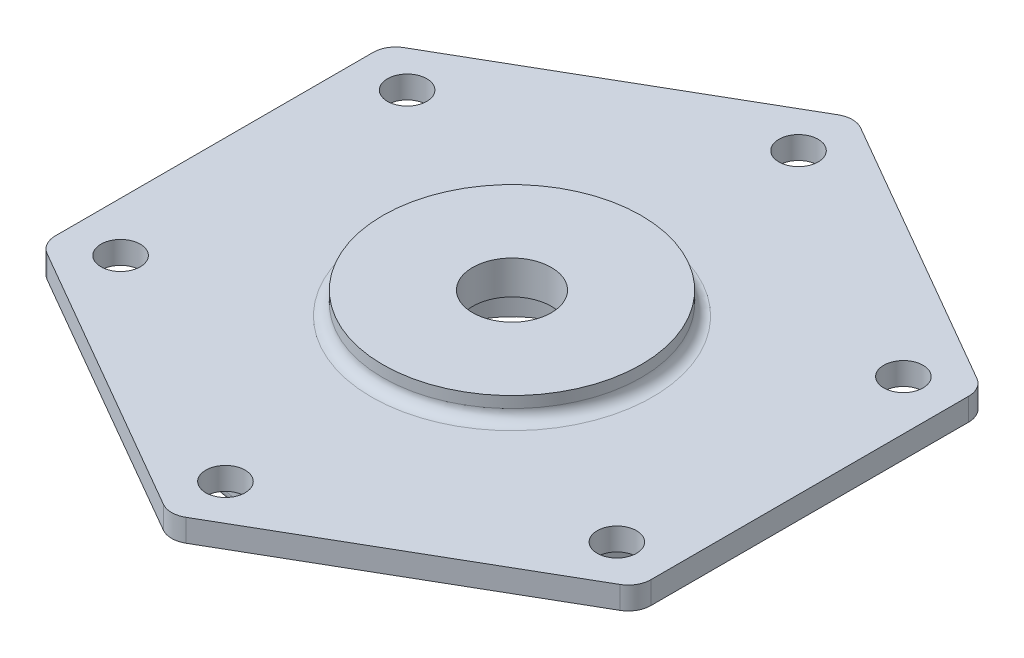
ISO-10303-21;
HEADER;
FILE_DESCRIPTION(('STEP AP214'),'2;1');
FILE_NAME('part.step','',(''),(''),'','','');
FILE_SCHEMA(('AUTOMOTIVE_DESIGN { 1 0 10303 214 1 1 1 1 }'));
ENDSEC;
DATA;
#1=APPLICATION_CONTEXT('core data for automotive mechanical design processes');
#2=APPLICATION_PROTOCOL_DEFINITION('international standard','automotive_design',2000,#1);
#3=PRODUCT_CONTEXT('',#1,'mechanical');
#4=PRODUCT('Part','Part','',(#3));
#5=PRODUCT_RELATED_PRODUCT_CATEGORY('part','',(#4));
#6=PRODUCT_DEFINITION_FORMATION('','',#4);
#7=PRODUCT_DEFINITION_CONTEXT('part definition',#1,'design');
#8=PRODUCT_DEFINITION('design','',#6,#7);
#9=PRODUCT_DEFINITION_SHAPE('','',#8);
#10=(LENGTH_UNIT() NAMED_UNIT(*) SI_UNIT(.MILLI.,.METRE.));
#11=(NAMED_UNIT(*) PLANE_ANGLE_UNIT() SI_UNIT($,.RADIAN.));
#12=(NAMED_UNIT(*) SI_UNIT($,.STERADIAN.) SOLID_ANGLE_UNIT());
#13=UNCERTAINTY_MEASURE_WITH_UNIT(LENGTH_MEASURE(1.E-05),#10,'distance_accuracy_value','');
#14=(GEOMETRIC_REPRESENTATION_CONTEXT(3) GLOBAL_UNCERTAINTY_ASSIGNED_CONTEXT((#13)) GLOBAL_UNIT_ASSIGNED_CONTEXT((#10,
#11,#12)) REPRESENTATION_CONTEXT('',''));
#15=CARTESIAN_POINT('',(0.,0.,0.));
#16=DIRECTION('',(0.,0.,1.));
#17=DIRECTION('',(1.,0.,0.));
#18=AXIS2_PLACEMENT_3D('',#15,#16,#17);
#19=CARTESIAN_POINT('',(48.9999999999997,4.,-28.2901631902923));
#20=DIRECTION('',(0.,-1.,0.));
#21=DIRECTION('',(0.,0.,-1.));
#22=AXIS2_PLACEMENT_3D('',#19,#20,#21);
#23=CYLINDRICAL_SURFACE('',#22,4.);
#24=CARTESIAN_POINT('',(48.9999999999997,0.,-28.2901631902923));
#25=DIRECTION('',(0.,1.,0.));
#26=DIRECTION('',(0.,0.,1.));
#27=AXIS2_PLACEMENT_3D('',#24,#25,#26);
#28=CIRCLE('',#27,4.);
#29=CARTESIAN_POINT('',(52.9999999999997,0.,-28.2901631902923));
#30=VERTEX_POINT('',#29);
#31=CARTESIAN_POINT('',(50.9999999999997,0.,-31.7542648054301));
#32=VERTEX_POINT('',#31);
#33=EDGE_CURVE('E167',#30,#32,#28,.T.);
#34=ORIENTED_EDGE('',*,*,#33,.T.);
#35=DIRECTION('',(0.,-1.,0.));
#36=VECTOR('',#35,1.);
#37=CARTESIAN_POINT('',(50.9999999999997,4.,-31.7542648054301));
#38=LINE('',#37,#36);
#39=CARTESIAN_POINT('',(50.9999999999997,4.,-31.7542648054301));
#40=VERTEX_POINT('',#39);
#41=EDGE_CURVE('E237',#40,#32,#38,.T.);
#42=ORIENTED_EDGE('',*,*,#41,.F.);
#43=CARTESIAN_POINT('',(48.9999999999997,4.,-28.2901631902923));
#44=DIRECTION('',(0.,1.,0.));
#45=DIRECTION('',(0.,0.,1.));
#46=AXIS2_PLACEMENT_3D('',#43,#44,#45);
#47=CIRCLE('',#46,4.);
#48=CARTESIAN_POINT('',(52.9999999999997,4.,-28.2901631902923));
#49=VERTEX_POINT('',#48);
#50=EDGE_CURVE('E202',#49,#40,#47,.T.);
#51=ORIENTED_EDGE('',*,*,#50,.F.);
#52=DIRECTION('',(0.,-1.,0.));
#53=VECTOR('',#52,1.);
#54=CARTESIAN_POINT('',(52.9999999999997,4.,-28.2901631902923));
#55=LINE('',#54,#53);
#56=EDGE_CURVE('E163',#49,#30,#55,.T.);
#57=ORIENTED_EDGE('',*,*,#56,.T.);
#58=EDGE_LOOP('',(#34,#42,#51,#57));
#59=FACE_BOUND('',#58,.T.);
#60=ADVANCED_FACE('F38',(#59),#23,.T.);
#61=CARTESIAN_POINT('',(50.9999999999997,4.,-31.7542648054301));
#62=DIRECTION('',(-0.499999999999995,0.,0.866025403784442));
#63=DIRECTION('',(0.866025403784442,0.,0.499999999999995));
#64=AXIS2_PLACEMENT_3D('',#61,#62,#63);
#65=PLANE('',#64);
#66=DIRECTION('',(-0.866025403784442,0.,-0.499999999999995));
#67=VECTOR('',#66,1.);
#68=CARTESIAN_POINT('',(50.9999999999997,0.,-31.7542648054301));
#69=LINE('',#68,#67);
#70=CARTESIAN_POINT('',(2.00000000000001,0.,-60.0444279957211));
#71=VERTEX_POINT('',#70);
#72=EDGE_CURVE('E171',#32,#71,#69,.T.);
#73=ORIENTED_EDGE('',*,*,#72,.T.);
#74=DIRECTION('',(0.,-1.,0.));
#75=VECTOR('',#74,1.);
#76=CARTESIAN_POINT('',(2.00000000000001,4.,-60.0444279957211));
#77=LINE('',#76,#75);
#78=CARTESIAN_POINT('',(2.00000000000001,4.,-60.0444279957211));
#79=VERTEX_POINT('',#78);
#80=EDGE_CURVE('E233',#79,#71,#77,.T.);
#81=ORIENTED_EDGE('',*,*,#80,.F.);
#82=DIRECTION('',(-0.866025403784442,0.,-0.499999999999995));
#83=VECTOR('',#82,1.);
#84=CARTESIAN_POINT('',(50.9999999999997,4.,-31.7542648054301));
#85=LINE('',#84,#83);
#86=EDGE_CURVE('E114',#40,#79,#85,.T.);
#87=ORIENTED_EDGE('',*,*,#86,.F.);
#88=ORIENTED_EDGE('',*,*,#41,.T.);
#89=EDGE_LOOP('',(#73,#81,#87,#88));
#90=FACE_BOUND('',#89,.T.);
#91=ADVANCED_FACE('F375',(#90),#65,.F.);
#92=CARTESIAN_POINT('',(0.,4.,-56.5803263805834));
#93=DIRECTION('',(0.,-1.,0.));
#94=DIRECTION('',(0.,0.,-1.));
#95=AXIS2_PLACEMENT_3D('',#92,#93,#94);
#96=CYLINDRICAL_SURFACE('',#95,4.);
#97=CARTESIAN_POINT('',(0.,0.,-56.5803263805834));
#98=DIRECTION('',(0.,1.,0.));
#99=DIRECTION('',(0.,0.,-1.));
#100=AXIS2_PLACEMENT_3D('',#97,#98,#99);
#101=CIRCLE('',#100,4.);
#102=CARTESIAN_POINT('',(-2.,0.,-60.0444279957211));
#103=VERTEX_POINT('',#102);
#104=EDGE_CURVE('E175',#71,#103,#101,.T.);
#105=ORIENTED_EDGE('',*,*,#104,.T.);
#106=DIRECTION('',(0.,-1.,0.));
#107=VECTOR('',#106,1.);
#108=CARTESIAN_POINT('',(-2.,4.,-60.0444279957211));
#109=LINE('',#108,#107);
#110=CARTESIAN_POINT('',(-2.,4.,-60.0444279957211));
#111=VERTEX_POINT('',#110);
#112=EDGE_CURVE('E229',#111,#103,#109,.T.);
#113=ORIENTED_EDGE('',*,*,#112,.F.);
#114=CARTESIAN_POINT('',(0.,4.,-56.5803263805834));
#115=DIRECTION('',(0.,1.,0.));
#116=DIRECTION('',(0.,0.,-1.));
#117=AXIS2_PLACEMENT_3D('',#114,#115,#116);
#118=CIRCLE('',#117,4.);
#119=EDGE_CURVE('E327',#79,#111,#118,.T.);
#120=ORIENTED_EDGE('',*,*,#119,.F.);
#121=ORIENTED_EDGE('',*,*,#80,.T.);
#122=EDGE_LOOP('',(#105,#113,#120,#121));
#123=FACE_BOUND('',#122,.T.);
#124=ADVANCED_FACE('F380',(#123),#96,.T.);
#125=CARTESIAN_POINT('',(-2.,4.,-60.0444279957211));
#126=DIRECTION('',(0.500000000000001,0.,0.866025403784438));
#127=DIRECTION('',(0.866025403784438,0.,-0.500000000000001));
#128=AXIS2_PLACEMENT_3D('',#125,#126,#127);
#129=PLANE('',#128);
#130=DIRECTION('',(-0.866025403784438,0.,0.500000000000001));
#131=VECTOR('',#130,1.);
#132=CARTESIAN_POINT('',(-2.,0.,-60.0444279957211));
#133=LINE('',#132,#131);
#134=CARTESIAN_POINT('',(-51.0000000000001,0.,-31.7542648054293));
#135=VERTEX_POINT('',#134);
#136=EDGE_CURVE('E178',#103,#135,#133,.T.);
#137=ORIENTED_EDGE('',*,*,#136,.T.);
#138=DIRECTION('',(0.,-1.,0.));
#139=VECTOR('',#138,1.);
#140=CARTESIAN_POINT('',(-51.0000000000001,4.,-31.7542648054293));
#141=LINE('',#140,#139);
#142=CARTESIAN_POINT('',(-51.0000000000001,4.,-31.7542648054293));
#143=VERTEX_POINT('',#142);
#144=EDGE_CURVE('E225',#143,#135,#141,.T.);
#145=ORIENTED_EDGE('',*,*,#144,.F.);
#146=DIRECTION('',(-0.866025403784438,0.,0.500000000000001));
#147=VECTOR('',#146,1.);
#148=CARTESIAN_POINT('',(-2.,4.,-60.0444279957211));
#149=LINE('',#148,#147);
#150=EDGE_CURVE('E330',#111,#143,#149,.T.);
#151=ORIENTED_EDGE('',*,*,#150,.F.);
#152=ORIENTED_EDGE('',*,*,#112,.T.);
#153=EDGE_LOOP('',(#137,#145,#151,#152));
#154=FACE_BOUND('',#153,.T.);
#155=ADVANCED_FACE('F640',(#154),#129,.F.);
#156=CARTESIAN_POINT('',(-49.0000000000001,4.,-28.2901631902916));
#157=DIRECTION('',(0.,-1.,0.));
#158=DIRECTION('',(0.,0.,-1.));
#159=AXIS2_PLACEMENT_3D('',#156,#157,#158);
#160=CYLINDRICAL_SURFACE('',#159,4.);
#161=CARTESIAN_POINT('',(-49.0000000000001,0.,-28.2901631902916));
#162=DIRECTION('',(0.,1.,0.));
#163=DIRECTION('',(0.,0.,1.));
#164=AXIS2_PLACEMENT_3D('',#161,#162,#163);
#165=CIRCLE('',#164,4.);
#166=CARTESIAN_POINT('',(-53.0000000000001,0.,-28.2901631902915));
#167=VERTEX_POINT('',#166);
#168=EDGE_CURVE('E181',#135,#167,#165,.T.);
#169=ORIENTED_EDGE('',*,*,#168,.T.);
#170=DIRECTION('',(0.,-1.,0.));
#171=VECTOR('',#170,1.);
#172=CARTESIAN_POINT('',(-53.0000000000001,4.,-28.2901631902915));
#173=LINE('',#172,#171);
#174=CARTESIAN_POINT('',(-53.0000000000001,4.,-28.2901631902915));
#175=VERTEX_POINT('',#174);
#176=EDGE_CURVE('E221',#175,#167,#173,.T.);
#177=ORIENTED_EDGE('',*,*,#176,.F.);
#178=CARTESIAN_POINT('',(-49.0000000000001,4.,-28.2901631902916));
#179=DIRECTION('',(0.,1.,0.));
#180=DIRECTION('',(0.,0.,1.));
#181=AXIS2_PLACEMENT_3D('',#178,#179,#180);
#182=CIRCLE('',#181,4.);
#183=EDGE_CURVE('E333',#143,#175,#182,.T.);
#184=ORIENTED_EDGE('',*,*,#183,.F.);
#185=ORIENTED_EDGE('',*,*,#144,.T.);
#186=EDGE_LOOP('',(#169,#177,#184,#185));
#187=FACE_BOUND('',#186,.T.);
#188=ADVANCED_FACE('F630',(#187),#160,.T.);
#189=CARTESIAN_POINT('',(-53.0000000000001,4.,-28.2901631902915));
#190=DIRECTION('',(1.,0.,0.));
#191=DIRECTION('',(0.,0.,-1.));
#192=AXIS2_PLACEMENT_3D('',#189,#190,#191);
#193=PLANE('',#192);
#194=DIRECTION('',(0.,0.,1.));
#195=VECTOR('',#194,1.);
#196=CARTESIAN_POINT('',(-53.0000000000001,0.,-28.2901631902915));
#197=LINE('',#196,#195);
#198=CARTESIAN_POINT('',(-52.9999999999999,0.,28.2901631902919));
#199=VERTEX_POINT('',#198);
#200=EDGE_CURVE('E184',#167,#199,#197,.T.);
#201=ORIENTED_EDGE('',*,*,#200,.T.);
#202=DIRECTION('',(0.,-1.,0.));
#203=VECTOR('',#202,1.);
#204=CARTESIAN_POINT('',(-52.9999999999999,4.,28.2901631902919));
#205=LINE('',#204,#203);
#206=CARTESIAN_POINT('',(-52.9999999999999,4.,28.2901631902919));
#207=VERTEX_POINT('',#206);
#208=EDGE_CURVE('E217',#207,#199,#205,.T.);
#209=ORIENTED_EDGE('',*,*,#208,.F.);
#210=DIRECTION('',(0.,0.,1.));
#211=VECTOR('',#210,1.);
#212=CARTESIAN_POINT('',(-53.0000000000001,4.,-28.2901631902915));
#213=LINE('',#212,#211);
#214=EDGE_CURVE('E336',#175,#207,#213,.T.);
#215=ORIENTED_EDGE('',*,*,#214,.F.);
#216=ORIENTED_EDGE('',*,*,#176,.T.);
#217=EDGE_LOOP('',(#201,#209,#215,#216));
#218=FACE_BOUND('',#217,.T.);
#219=ADVANCED_FACE('F620',(#218),#193,.F.);
#220=CARTESIAN_POINT('',(-48.9999999999999,4.,28.2901631902919));
#221=DIRECTION('',(0.,-1.,0.));
#222=DIRECTION('',(0.,0.,-1.));
#223=AXIS2_PLACEMENT_3D('',#220,#221,#222);
#224=CYLINDRICAL_SURFACE('',#223,4.);
#225=CARTESIAN_POINT('',(-48.9999999999999,0.,28.2901631902919));
#226=DIRECTION('',(0.,1.,0.));
#227=DIRECTION('',(0.,0.,1.));
#228=AXIS2_PLACEMENT_3D('',#225,#226,#227);
#229=CIRCLE('',#228,4.);
#230=CARTESIAN_POINT('',(-50.9999999999999,0.,31.7542648054297));
#231=VERTEX_POINT('',#230);
#232=EDGE_CURVE('E187',#199,#231,#229,.T.);
#233=ORIENTED_EDGE('',*,*,#232,.T.);
#234=DIRECTION('',(0.,-1.,0.));
#235=VECTOR('',#234,1.);
#236=CARTESIAN_POINT('',(-50.9999999999999,4.,31.7542648054297));
#237=LINE('',#236,#235);
#238=CARTESIAN_POINT('',(-50.9999999999999,4.,31.7542648054297));
#239=VERTEX_POINT('',#238);
#240=EDGE_CURVE('E213',#239,#231,#237,.T.);
#241=ORIENTED_EDGE('',*,*,#240,.F.);
#242=CARTESIAN_POINT('',(-48.9999999999999,4.,28.2901631902919));
#243=DIRECTION('',(0.,1.,0.));
#244=DIRECTION('',(0.,0.,1.));
#245=AXIS2_PLACEMENT_3D('',#242,#243,#244);
#246=CIRCLE('',#245,4.);
#247=EDGE_CURVE('E339',#207,#239,#246,.T.);
#248=ORIENTED_EDGE('',*,*,#247,.F.);
#249=ORIENTED_EDGE('',*,*,#208,.T.);
#250=EDGE_LOOP('',(#233,#241,#248,#249));
#251=FACE_BOUND('',#250,.T.);
#252=ADVANCED_FACE('F611',(#251),#224,.T.);
#253=CARTESIAN_POINT('',(-50.9999999999999,4.,31.7542648054297));
#254=DIRECTION('',(0.499999999999995,0.,-0.866025403784442));
#255=DIRECTION('',(-0.866025403784442,0.,-0.499999999999995));
#256=AXIS2_PLACEMENT_3D('',#253,#254,#255);
#257=PLANE('',#256);
#258=DIRECTION('',(0.866025403784442,0.,0.499999999999995));
#259=VECTOR('',#258,1.);
#260=CARTESIAN_POINT('',(-50.9999999999999,0.,31.7542648054297));
#261=LINE('',#260,#259);
#262=CARTESIAN_POINT('',(-1.9999999999996,0.,60.0444279957211));
#263=VERTEX_POINT('',#262);
#264=EDGE_CURVE('E190',#231,#263,#261,.T.);
#265=ORIENTED_EDGE('',*,*,#264,.T.);
#266=DIRECTION('',(0.,-1.,0.));
#267=VECTOR('',#266,1.);
#268=CARTESIAN_POINT('',(-1.9999999999996,4.,60.0444279957211));
#269=LINE('',#268,#267);
#270=CARTESIAN_POINT('',(-1.9999999999996,4.,60.0444279957211));
#271=VERTEX_POINT('',#270);
#272=EDGE_CURVE('E209',#271,#263,#269,.T.);
#273=ORIENTED_EDGE('',*,*,#272,.F.);
#274=DIRECTION('',(0.866025403784442,0.,0.499999999999995));
#275=VECTOR('',#274,1.);
#276=CARTESIAN_POINT('',(-50.9999999999999,4.,31.7542648054297));
#277=LINE('',#276,#275);
#278=EDGE_CURVE('E342',#239,#271,#277,.T.);
#279=ORIENTED_EDGE('',*,*,#278,.F.);
#280=ORIENTED_EDGE('',*,*,#240,.T.);
#281=EDGE_LOOP('',(#265,#273,#279,#280));
#282=FACE_BOUND('',#281,.T.);
#283=ADVANCED_FACE('F350',(#282),#257,.F.);
#284=CARTESIAN_POINT('',(3.96071037428708E-13,4.,56.5803263805834));
#285=DIRECTION('',(0.,-1.,0.));
#286=DIRECTION('',(0.,0.,-1.));
#287=AXIS2_PLACEMENT_3D('',#284,#285,#286);
#288=CYLINDRICAL_SURFACE('',#287,4.);
#289=CARTESIAN_POINT('',(3.96071037428708E-13,0.,56.5803263805834));
#290=DIRECTION('',(0.,1.,0.));
#291=DIRECTION('',(0.,0.,1.));
#292=AXIS2_PLACEMENT_3D('',#289,#290,#291);
#293=CIRCLE('',#292,4.);
#294=CARTESIAN_POINT('',(2.00000000000044,0.,60.0444279957211));
#295=VERTEX_POINT('',#294);
#296=EDGE_CURVE('E193',#263,#295,#293,.T.);
#297=ORIENTED_EDGE('',*,*,#296,.T.);
#298=DIRECTION('',(0.,-1.,0.));
#299=VECTOR('',#298,1.);
#300=CARTESIAN_POINT('',(2.00000000000044,4.,60.0444279957211));
#301=LINE('',#300,#299);
#302=CARTESIAN_POINT('',(2.00000000000044,4.,60.0444279957211));
#303=VERTEX_POINT('',#302);
#304=EDGE_CURVE('E156',#303,#295,#301,.T.);
#305=ORIENTED_EDGE('',*,*,#304,.F.);
#306=CARTESIAN_POINT('',(3.96071037428708E-13,4.,56.5803263805834));
#307=DIRECTION('',(0.,1.,0.));
#308=DIRECTION('',(0.,0.,1.));
#309=AXIS2_PLACEMENT_3D('',#306,#307,#308);
#310=CIRCLE('',#309,4.);
#311=EDGE_CURVE('E145',#271,#303,#310,.T.);
#312=ORIENTED_EDGE('',*,*,#311,.F.);
#313=ORIENTED_EDGE('',*,*,#272,.T.);
#314=EDGE_LOOP('',(#297,#305,#312,#313));
#315=FACE_BOUND('',#314,.T.);
#316=ADVANCED_FACE('F354',(#315),#288,.T.);
#317=CARTESIAN_POINT('',(2.00000000000044,4.,60.0444279957211));
#318=DIRECTION('',(-0.500000000000007,0.,-0.866025403784435));
#319=DIRECTION('',(-0.866025403784434,0.,0.500000000000007));
#320=AXIS2_PLACEMENT_3D('',#317,#318,#319);
#321=PLANE('',#320);
#322=DIRECTION('',(0.866025403784435,0.,-0.500000000000007));
#323=VECTOR('',#322,1.);
#324=CARTESIAN_POINT('',(2.00000000000044,0.,60.0444279957211));
#325=LINE('',#324,#323);
#326=CARTESIAN_POINT('',(51.0000000000003,0.,31.754264805429));
#327=VERTEX_POINT('',#326);
#328=EDGE_CURVE('E154',#295,#327,#325,.T.);
#329=ORIENTED_EDGE('',*,*,#328,.T.);
#330=DIRECTION('',(0.,-1.,0.));
#331=VECTOR('',#330,1.);
#332=CARTESIAN_POINT('',(51.0000000000003,4.,31.754264805429));
#333=LINE('',#332,#331);
#334=CARTESIAN_POINT('',(51.0000000000003,4.,31.754264805429));
#335=VERTEX_POINT('',#334);
#336=EDGE_CURVE('E151',#335,#327,#333,.T.);
#337=ORIENTED_EDGE('',*,*,#336,.F.);
#338=DIRECTION('',(0.866025403784435,0.,-0.500000000000007));
#339=VECTOR('',#338,1.);
#340=CARTESIAN_POINT('',(2.00000000000044,4.,60.0444279957211));
#341=LINE('',#340,#339);
#342=EDGE_CURVE('E139',#303,#335,#341,.T.);
#343=ORIENTED_EDGE('',*,*,#342,.F.);
#344=ORIENTED_EDGE('',*,*,#304,.T.);
#345=EDGE_LOOP('',(#329,#337,#343,#344));
#346=FACE_BOUND('',#345,.T.);
#347=ADVANCED_FACE('F152',(#346),#321,.F.);
#348=CARTESIAN_POINT('',(49.0000000000003,4.,28.2901631902912));
#349=DIRECTION('',(0.,-1.,0.));
#350=DIRECTION('',(0.,0.,-1.));
#351=AXIS2_PLACEMENT_3D('',#348,#349,#350);
#352=CYLINDRICAL_SURFACE('',#351,4.);
#353=CARTESIAN_POINT('',(49.0000000000003,0.,28.2901631902912));
#354=DIRECTION('',(0.,1.,0.));
#355=DIRECTION('',(0.,0.,1.));
#356=AXIS2_PLACEMENT_3D('',#353,#354,#355);
#357=CIRCLE('',#356,4.);
#358=CARTESIAN_POINT('',(53.0000000000003,0.,28.2901631902912));
#359=VERTEX_POINT('',#358);
#360=EDGE_CURVE('E99',#327,#359,#357,.T.);
#361=ORIENTED_EDGE('',*,*,#360,.T.);
#362=DIRECTION('',(0.,-1.,0.));
#363=VECTOR('',#362,1.);
#364=CARTESIAN_POINT('',(53.0000000000003,4.,28.2901631902912));
#365=LINE('',#364,#363);
#366=CARTESIAN_POINT('',(53.0000000000003,4.,28.2901631902912));
#367=VERTEX_POINT('',#366);
#368=EDGE_CURVE('E157',#367,#359,#365,.T.);
#369=ORIENTED_EDGE('',*,*,#368,.F.);
#370=CARTESIAN_POINT('',(49.0000000000003,4.,28.2901631902912));
#371=DIRECTION('',(0.,1.,0.));
#372=DIRECTION('',(0.,0.,1.));
#373=AXIS2_PLACEMENT_3D('',#370,#371,#372);
#374=CIRCLE('',#373,4.);
#375=EDGE_CURVE('E143',#335,#367,#374,.T.);
#376=ORIENTED_EDGE('',*,*,#375,.F.);
#377=ORIENTED_EDGE('',*,*,#336,.T.);
#378=EDGE_LOOP('',(#361,#369,#376,#377));
#379=FACE_BOUND('',#378,.T.);
#380=ADVANCED_FACE('F159',(#379),#352,.T.);
#381=CARTESIAN_POINT('',(53.0000000000003,4.,28.2901631902912));
#382=DIRECTION('',(-1.,0.,0.));
#383=DIRECTION('',(0.,0.,1.));
#384=AXIS2_PLACEMENT_3D('',#381,#382,#383);
#385=PLANE('',#384);
#386=DIRECTION('',(0.,0.,-1.));
#387=VECTOR('',#386,1.);
#388=CARTESIAN_POINT('',(53.0000000000003,0.,28.2901631902912));
#389=LINE('',#388,#387);
#390=EDGE_CURVE('E105',#359,#30,#389,.T.);
#391=ORIENTED_EDGE('',*,*,#390,.T.);
#392=ORIENTED_EDGE('',*,*,#56,.F.);
#393=DIRECTION('',(0.,0.,-1.));
#394=VECTOR('',#393,1.);
#395=CARTESIAN_POINT('',(53.0000000000003,4.,28.2901631902912));
#396=LINE('',#395,#394);
#397=EDGE_CURVE('E58',#367,#49,#396,.T.);
#398=ORIENTED_EDGE('',*,*,#397,.F.);
#399=ORIENTED_EDGE('',*,*,#368,.T.);
#400=EDGE_LOOP('',(#391,#392,#398,#399));
#401=FACE_BOUND('',#400,.T.);
#402=ADVANCED_FACE('F362',(#401),#385,.F.);
#403=CARTESIAN_POINT('',(48.9999999999997,4.,-28.2901631902923));
#404=DIRECTION('',(0.,1.,0.));
#405=DIRECTION('',(0.,0.,1.));
#406=AXIS2_PLACEMENT_3D('',#403,#404,#405);
#407=PLANE('',#406);
#408=CARTESIAN_POINT('',(0.,4.,-51.));
#409=DIRECTION('',(0.,1.,0.));
#410=DIRECTION('',(0.,0.,1.));
#411=AXIS2_PLACEMENT_3D('',#408,#409,#410);
#412=CIRCLE('',#411,3.5);
#413=CARTESIAN_POINT('',(0.,4.,-47.5));
#414=VERTEX_POINT('',#413);
#415=EDGE_CURVE('E265',#414,#414,#412,.T.);
#416=ORIENTED_EDGE('',*,*,#415,.F.);
#417=EDGE_LOOP('',(#416));
#418=FACE_BOUND('',#417,.T.);
#419=CARTESIAN_POINT('',(-44.1672955930061,4.,-25.5000000000005));
#420=DIRECTION('',(0.,1.,0.));
#421=DIRECTION('',(0.,0.,1.));
#422=AXIS2_PLACEMENT_3D('',#419,#420,#421);
#423=CIRCLE('',#422,3.5);
#424=CARTESIAN_POINT('',(-44.1672955930061,4.,-22.0000000000005));
#425=VERTEX_POINT('',#424);
#426=EDGE_CURVE('E734',#425,#425,#423,.T.);
#427=ORIENTED_EDGE('',*,*,#426,.F.);
#428=EDGE_LOOP('',(#427));
#429=FACE_BOUND('',#428,.T.);
#430=CARTESIAN_POINT('',(-44.1672955930053,4.,25.5000000000006));
#431=DIRECTION('',(0.,1.,0.));
#432=DIRECTION('',(0.,0.,1.));
#433=AXIS2_PLACEMENT_3D('',#430,#431,#432);
#434=CIRCLE('',#433,3.50000000000169);
#435=CARTESIAN_POINT('',(-44.1672955930053,4.,29.0000000000023));
#436=VERTEX_POINT('',#435);
#437=EDGE_CURVE('E737',#436,#436,#434,.T.);
#438=ORIENTED_EDGE('',*,*,#437,.F.);
#439=EDGE_LOOP('',(#438));
#440=FACE_BOUND('',#439,.T.);
#441=CARTESIAN_POINT('',(1.43077008492365E-12,4.,51.));
#442=DIRECTION('',(0.,1.,0.));
#443=DIRECTION('',(0.,0.,1.));
#444=AXIS2_PLACEMENT_3D('',#441,#442,#443);
#445=CIRCLE('',#444,3.50000000000171);
#446=CARTESIAN_POINT('',(1.43077008492365E-12,4.,54.5000000000017));
#447=VERTEX_POINT('',#446);
#448=EDGE_CURVE('E742',#447,#447,#445,.T.);
#449=ORIENTED_EDGE('',*,*,#448,.F.);
#450=EDGE_LOOP('',(#449));
#451=FACE_BOUND('',#450,.T.);
#452=CARTESIAN_POINT('',(44.1672955930074,4.,25.4999999999994));
#453=DIRECTION('',(0.,1.,0.));
#454=DIRECTION('',(0.,0.,1.));
#455=AXIS2_PLACEMENT_3D('',#452,#453,#454);
#456=CIRCLE('',#455,3.50000000000108);
#457=CARTESIAN_POINT('',(44.1672955930074,4.,29.0000000000005));
#458=VERTEX_POINT('',#457);
#459=EDGE_CURVE('E731',#458,#458,#456,.T.);
#460=ORIENTED_EDGE('',*,*,#459,.F.);
#461=EDGE_LOOP('',(#460));
#462=FACE_BOUND('',#461,.T.);
#463=CARTESIAN_POINT('',(44.1672955930064,4.,-25.4999999999999));
#464=DIRECTION('',(0.,1.,0.));
#465=DIRECTION('',(0.,0.,1.));
#466=AXIS2_PLACEMENT_3D('',#463,#464,#465);
#467=CIRCLE('',#466,3.5);
#468=CARTESIAN_POINT('',(44.1672955930064,4.,-21.9999999999999));
#469=VERTEX_POINT('',#468);
#470=EDGE_CURVE('E728',#469,#469,#467,.T.);
#471=ORIENTED_EDGE('',*,*,#470,.F.);
#472=EDGE_LOOP('',(#471));
#473=FACE_BOUND('',#472,.T.);
#474=CARTESIAN_POINT('',(0.,4.,0.));
#475=DIRECTION('',(0.,1.,0.));
#476=DIRECTION('',(0.,0.,1.));
#477=AXIS2_PLACEMENT_3D('',#474,#475,#476);
#478=CIRCLE('',#477,25.);
#479=CARTESIAN_POINT('',(0.,4.,25.));
#480=VERTEX_POINT('',#479);
#481=EDGE_CURVE('E245',#480,#480,#478,.F.);
#482=ORIENTED_EDGE('',*,*,#481,.T.);
#483=EDGE_LOOP('',(#482));
#484=FACE_BOUND('',#483,.T.);
#485=ORIENTED_EDGE('',*,*,#50,.T.);
#486=ORIENTED_EDGE('',*,*,#86,.T.);
#487=ORIENTED_EDGE('',*,*,#119,.T.);
#488=ORIENTED_EDGE('',*,*,#150,.T.);
#489=ORIENTED_EDGE('',*,*,#183,.T.);
#490=ORIENTED_EDGE('',*,*,#214,.T.);
#491=ORIENTED_EDGE('',*,*,#247,.T.);
#492=ORIENTED_EDGE('',*,*,#278,.T.);
#493=ORIENTED_EDGE('',*,*,#311,.T.);
#494=ORIENTED_EDGE('',*,*,#342,.T.);
#495=ORIENTED_EDGE('',*,*,#375,.T.);
#496=ORIENTED_EDGE('',*,*,#397,.T.);
#497=EDGE_LOOP('',(#485,#486,#487,#488,#489,#490,#491,#492,#493,#494,#495,#496));
#498=FACE_BOUND('',#497,.T.);
#499=ADVANCED_FACE('F141',(#418,#429,#440,#451,#462,#473,#484,#498),#407,.T.);
#500=CARTESIAN_POINT('',(48.9999999999997,0.,-28.2901631902923));
#501=DIRECTION('',(0.,1.,0.));
#502=DIRECTION('',(0.,0.,1.));
#503=AXIS2_PLACEMENT_3D('',#500,#501,#502);
#504=PLANE('',#503);
#505=CARTESIAN_POINT('',(0.,0.,-51.));
#506=DIRECTION('',(0.,1.,0.));
#507=DIRECTION('',(0.,0.,1.));
#508=AXIS2_PLACEMENT_3D('',#505,#506,#507);
#509=CIRCLE('',#508,3.5);
#510=CARTESIAN_POINT('',(0.,0.,-47.5));
#511=VERTEX_POINT('',#510);
#512=EDGE_CURVE('E42',#511,#511,#509,.T.);
#513=ORIENTED_EDGE('',*,*,#512,.T.);
#514=EDGE_LOOP('',(#513));
#515=FACE_BOUND('',#514,.T.);
#516=CARTESIAN_POINT('',(-44.1672955930061,0.,-25.5000000000005));
#517=DIRECTION('',(0.,1.,0.));
#518=DIRECTION('',(0.,0.,1.));
#519=AXIS2_PLACEMENT_3D('',#516,#517,#518);
#520=CIRCLE('',#519,3.5);
#521=CARTESIAN_POINT('',(-44.1672955930061,0.,-22.0000000000005));
#522=VERTEX_POINT('',#521);
#523=EDGE_CURVE('E276',#522,#522,#520,.T.);
#524=ORIENTED_EDGE('',*,*,#523,.T.);
#525=EDGE_LOOP('',(#524));
#526=FACE_BOUND('',#525,.T.);
#527=CARTESIAN_POINT('',(-44.1672955930053,0.,25.5000000000006));
#528=DIRECTION('',(0.,1.,0.));
#529=DIRECTION('',(0.,0.,1.));
#530=AXIS2_PLACEMENT_3D('',#527,#528,#529);
#531=CIRCLE('',#530,3.50000000000169);
#532=CARTESIAN_POINT('',(-44.1672955930053,0.,29.0000000000023));
#533=VERTEX_POINT('',#532);
#534=EDGE_CURVE('E273',#533,#533,#531,.T.);
#535=ORIENTED_EDGE('',*,*,#534,.T.);
#536=EDGE_LOOP('',(#535));
#537=FACE_BOUND('',#536,.T.);
#538=CARTESIAN_POINT('',(1.43077008492365E-12,0.,51.));
#539=DIRECTION('',(0.,1.,0.));
#540=DIRECTION('',(0.,0.,1.));
#541=AXIS2_PLACEMENT_3D('',#538,#539,#540);
#542=CIRCLE('',#541,3.50000000000171);
#543=CARTESIAN_POINT('',(1.43077008492365E-12,0.,54.5000000000017));
#544=VERTEX_POINT('',#543);
#545=EDGE_CURVE('E269',#544,#544,#542,.T.);
#546=ORIENTED_EDGE('',*,*,#545,.T.);
#547=EDGE_LOOP('',(#546));
#548=FACE_BOUND('',#547,.T.);
#549=CARTESIAN_POINT('',(44.1672955930074,0.,25.4999999999994));
#550=DIRECTION('',(0.,1.,0.));
#551=DIRECTION('',(0.,0.,1.));
#552=AXIS2_PLACEMENT_3D('',#549,#550,#551);
#553=CIRCLE('',#552,3.50000000000108);
#554=CARTESIAN_POINT('',(44.1672955930074,0.,29.0000000000005));
#555=VERTEX_POINT('',#554);
#556=EDGE_CURVE('E264',#555,#555,#553,.T.);
#557=ORIENTED_EDGE('',*,*,#556,.T.);
#558=EDGE_LOOP('',(#557));
#559=FACE_BOUND('',#558,.T.);
#560=CARTESIAN_POINT('',(44.1672955930064,0.,-25.4999999999999));
#561=DIRECTION('',(0.,1.,0.));
#562=DIRECTION('',(0.,0.,1.));
#563=AXIS2_PLACEMENT_3D('',#560,#561,#562);
#564=CIRCLE('',#563,3.5);
#565=CARTESIAN_POINT('',(44.1672955930064,0.,-21.9999999999999));
#566=VERTEX_POINT('',#565);
#567=EDGE_CURVE('E260',#566,#566,#564,.T.);
#568=ORIENTED_EDGE('',*,*,#567,.T.);
#569=EDGE_LOOP('',(#568));
#570=FACE_BOUND('',#569,.T.);
#571=CARTESIAN_POINT('',(0.,0.,0.));
#572=DIRECTION('',(0.,-1.,0.));
#573=DIRECTION('',(0.,0.,-1.));
#574=AXIS2_PLACEMENT_3D('',#571,#572,#573);
#575=CIRCLE('',#574,45.);
#576=CARTESIAN_POINT('',(0.,0.,-45.));
#577=VERTEX_POINT('',#576);
#578=EDGE_CURVE('E240',#577,#577,#575,.T.);
#579=ORIENTED_EDGE('',*,*,#578,.F.);
#580=EDGE_LOOP('',(#579));
#581=FACE_BOUND('',#580,.T.);
#582=ORIENTED_EDGE('',*,*,#33,.F.);
#583=ORIENTED_EDGE('',*,*,#390,.F.);
#584=ORIENTED_EDGE('',*,*,#360,.F.);
#585=ORIENTED_EDGE('',*,*,#328,.F.);
#586=ORIENTED_EDGE('',*,*,#296,.F.);
#587=ORIENTED_EDGE('',*,*,#264,.F.);
#588=ORIENTED_EDGE('',*,*,#232,.F.);
#589=ORIENTED_EDGE('',*,*,#200,.F.);
#590=ORIENTED_EDGE('',*,*,#168,.F.);
#591=ORIENTED_EDGE('',*,*,#136,.F.);
#592=ORIENTED_EDGE('',*,*,#104,.F.);
#593=ORIENTED_EDGE('',*,*,#72,.F.);
#594=EDGE_LOOP('',(#582,#583,#584,#585,#586,#587,#588,#589,#590,#591,#592,#593));
#595=FACE_BOUND('',#594,.T.);
#596=ADVANCED_FACE('F357',(#515,#526,#537,#548,#559,#570,#581,#595),#504,.F.);
#597=CARTESIAN_POINT('',(0.,8.,0.));
#598=DIRECTION('',(0.,-1.,0.));
#599=DIRECTION('',(0.,0.,-1.));
#600=AXIS2_PLACEMENT_3D('',#597,#598,#599);
#601=CYLINDRICAL_SURFACE('',#600,23.);
#602=CARTESIAN_POINT('',(0.,6.,0.));
#603=DIRECTION('',(0.,1.,0.));
#604=DIRECTION('',(0.,0.,1.));
#605=AXIS2_PLACEMENT_3D('',#602,#603,#604);
#606=CIRCLE('',#605,23.);
#607=CARTESIAN_POINT('',(0.,6.,23.));
#608=VERTEX_POINT('',#607);
#609=EDGE_CURVE('E241',#608,#608,#606,.T.);
#610=ORIENTED_EDGE('',*,*,#609,.T.);
#611=EDGE_LOOP('',(#610));
#612=FACE_BOUND('',#611,.T.);
#613=CARTESIAN_POINT('',(0.,8.,0.));
#614=DIRECTION('',(0.,1.,0.));
#615=DIRECTION('',(0.,0.,1.));
#616=AXIS2_PLACEMENT_3D('',#613,#614,#615);
#617=CIRCLE('',#616,23.);
#618=CARTESIAN_POINT('',(0.,8.,23.));
#619=VERTEX_POINT('',#618);
#620=EDGE_CURVE('E172',#619,#619,#617,.T.);
#621=ORIENTED_EDGE('',*,*,#620,.F.);
#622=EDGE_LOOP('',(#621));
#623=FACE_BOUND('',#622,.T.);
#624=ADVANCED_FACE('F429',(#612,#623),#601,.T.);
#625=CARTESIAN_POINT('',(0.,8.,0.));
#626=DIRECTION('',(0.,1.,0.));
#627=DIRECTION('',(0.,0.,1.));
#628=AXIS2_PLACEMENT_3D('',#625,#626,#627);
#629=PLANE('',#628);
#630=CARTESIAN_POINT('',(0.,8.,0.));
#631=DIRECTION('',(0.,-1.,0.));
#632=DIRECTION('',(0.,0.,-1.));
#633=AXIS2_PLACEMENT_3D('',#630,#631,#632);
#634=CIRCLE('',#633,7.);
#635=CARTESIAN_POINT('',(0.,8.,-7.));
#636=VERTEX_POINT('',#635);
#637=EDGE_CURVE('E288',#636,#636,#634,.T.);
#638=ORIENTED_EDGE('',*,*,#637,.T.);
#639=EDGE_LOOP('',(#638));
#640=FACE_BOUND('',#639,.T.);
#641=ORIENTED_EDGE('',*,*,#620,.T.);
#642=EDGE_LOOP('',(#641));
#643=FACE_BOUND('',#642,.T.);
#644=ADVANCED_FACE('F425',(#640,#643),#629,.T.);
#645=CARTESIAN_POINT('',(0.,-6.,0.));
#646=DIRECTION('',(0.,1.,0.));
#647=DIRECTION('',(0.,0.,1.));
#648=AXIS2_PLACEMENT_3D('',#645,#646,#647);
#649=CYLINDRICAL_SURFACE('',#648,45.);
#650=CARTESIAN_POINT('',(0.,-4.,0.));
#651=DIRECTION('',(0.,-1.,0.));
#652=DIRECTION('',(0.,0.,-1.));
#653=AXIS2_PLACEMENT_3D('',#650,#651,#652);
#654=CIRCLE('',#653,45.);
#655=CARTESIAN_POINT('',(0.,-4.,-45.));
#656=VERTEX_POINT('',#655);
#657=EDGE_CURVE('E253',#656,#656,#654,.F.);
#658=ORIENTED_EDGE('',*,*,#657,.T.);
#659=EDGE_LOOP('',(#658));
#660=FACE_BOUND('',#659,.T.);
#661=ORIENTED_EDGE('',*,*,#578,.T.);
#662=EDGE_LOOP('',(#661));
#663=FACE_BOUND('',#662,.T.);
#664=ADVANCED_FACE('F404',(#660,#663),#649,.T.);
#665=CARTESIAN_POINT('',(0.,-6.,0.));
#666=DIRECTION('',(0.,-1.,0.));
#667=DIRECTION('',(0.,0.,-1.));
#668=AXIS2_PLACEMENT_3D('',#665,#666,#667);
#669=PLANE('',#668);
#670=CARTESIAN_POINT('',(0.,-6.,0.));
#671=DIRECTION('',(0.,-1.,0.));
#672=DIRECTION('',(0.,0.,-1.));
#673=AXIS2_PLACEMENT_3D('',#670,#671,#672);
#674=CIRCLE('',#673,43.);
#675=CARTESIAN_POINT('',(0.,-6.,-43.));
#676=VERTEX_POINT('',#675);
#677=EDGE_CURVE('E249',#676,#676,#674,.T.);
#678=ORIENTED_EDGE('',*,*,#677,.T.);
#679=EDGE_LOOP('',(#678));
#680=FACE_BOUND('',#679,.T.);
#681=CARTESIAN_POINT('',(0.,-6.,0.));
#682=DIRECTION('',(0.,-1.,0.));
#683=DIRECTION('',(0.,0.,-1.));
#684=AXIS2_PLACEMENT_3D('',#681,#682,#683);
#685=CIRCLE('',#684,40.);
#686=CARTESIAN_POINT('',(0.,-6.,-40.));
#687=VERTEX_POINT('',#686);
#688=EDGE_CURVE('E309',#687,#687,#685,.T.);
#689=ORIENTED_EDGE('',*,*,#688,.F.);
#690=EDGE_LOOP('',(#689));
#691=FACE_BOUND('',#690,.T.);
#692=ADVANCED_FACE('F400',(#680,#691),#669,.T.);
#693=CARTESIAN_POINT('',(0.,0.,0.));
#694=DIRECTION('',(0.,-1.,0.));
#695=DIRECTION('',(0.,0.,-1.));
#696=AXIS2_PLACEMENT_3D('',#693,#694,#695);
#697=CYLINDRICAL_SURFACE('',#696,40.);
#698=CARTESIAN_POINT('',(0.,0.,0.));
#699=DIRECTION('',(0.,-1.,0.));
#700=DIRECTION('',(0.,0.,-1.));
#701=AXIS2_PLACEMENT_3D('',#698,#699,#700);
#702=CIRCLE('',#701,40.);
#703=CARTESIAN_POINT('',(0.,0.,-40.));
#704=VERTEX_POINT('',#703);
#705=EDGE_CURVE('E310',#704,#704,#702,.T.);
#706=ORIENTED_EDGE('',*,*,#705,.F.);
#707=EDGE_LOOP('',(#706));
#708=FACE_BOUND('',#707,.T.);
#709=ORIENTED_EDGE('',*,*,#688,.T.);
#710=EDGE_LOOP('',(#709));
#711=FACE_BOUND('',#710,.T.);
#712=ADVANCED_FACE('F403',(#708,#711),#697,.F.);
#713=CARTESIAN_POINT('',(0.,0.,0.));
#714=DIRECTION('',(0.,-1.,0.));
#715=DIRECTION('',(0.,0.,-1.));
#716=AXIS2_PLACEMENT_3D('',#713,#714,#715);
#717=PLANE('',#716);
#718=CARTESIAN_POINT('',(0.,0.,0.));
#719=DIRECTION('',(0.,-1.,0.));
#720=DIRECTION('',(0.,0.,-1.));
#721=AXIS2_PLACEMENT_3D('',#718,#719,#720);
#722=CIRCLE('',#721,19.);
#723=CARTESIAN_POINT('',(0.,0.,-19.));
#724=VERTEX_POINT('',#723);
#725=EDGE_CURVE('E302',#724,#724,#722,.T.);
#726=ORIENTED_EDGE('',*,*,#725,.F.);
#727=EDGE_LOOP('',(#726));
#728=FACE_BOUND('',#727,.T.);
#729=ORIENTED_EDGE('',*,*,#705,.T.);
#730=EDGE_LOOP('',(#729));
#731=FACE_BOUND('',#730,.T.);
#732=ADVANCED_FACE('F410',(#728,#731),#717,.T.);
#733=CARTESIAN_POINT('',(0.,0.,0.));
#734=DIRECTION('',(0.,-1.,0.));
#735=DIRECTION('',(0.,0.,-1.));
#736=AXIS2_PLACEMENT_3D('',#733,#734,#735);
#737=CYLINDRICAL_SURFACE('',#736,19.);
#738=CARTESIAN_POINT('',(0.,-4.,0.));
#739=DIRECTION('',(0.,-1.,0.));
#740=DIRECTION('',(0.,0.,-1.));
#741=AXIS2_PLACEMENT_3D('',#738,#739,#740);
#742=CIRCLE('',#741,19.);
#743=CARTESIAN_POINT('',(0.,-4.,-19.));
#744=VERTEX_POINT('',#743);
#745=EDGE_CURVE('E11',#744,#744,#742,.F.);
#746=ORIENTED_EDGE('',*,*,#745,.T.);
#747=EDGE_LOOP('',(#746));
#748=FACE_BOUND('',#747,.T.);
#749=ORIENTED_EDGE('',*,*,#725,.T.);
#750=EDGE_LOOP('',(#749));
#751=FACE_BOUND('',#750,.T.);
#752=ADVANCED_FACE('F417',(#748,#751),#737,.T.);
#753=CARTESIAN_POINT('',(0.,-6.,0.));
#754=DIRECTION('',(0.,-1.,0.));
#755=DIRECTION('',(0.,0.,-1.));
#756=AXIS2_PLACEMENT_3D('',#753,#754,#755);
#757=CIRCLE('',#756,17.);
#758=CARTESIAN_POINT('',(0.,-6.,-17.));
#759=VERTEX_POINT('',#758);
#760=EDGE_CURVE('E49',#759,#759,#757,.T.);
#761=ORIENTED_EDGE('',*,*,#760,.T.);
#762=EDGE_LOOP('',(#761));
#763=FACE_BOUND('',#762,.T.);
#764=CARTESIAN_POINT('',(0.,-6.,0.));
#765=DIRECTION('',(0.,-1.,0.));
#766=DIRECTION('',(0.,0.,-1.));
#767=AXIS2_PLACEMENT_3D('',#764,#765,#766);
#768=CIRCLE('',#767,14.);
#769=CARTESIAN_POINT('',(0.,-6.,-14.));
#770=VERTEX_POINT('',#769);
#771=EDGE_CURVE('E294',#770,#770,#768,.T.);
#772=ORIENTED_EDGE('',*,*,#771,.F.);
#773=EDGE_LOOP('',(#772));
#774=FACE_BOUND('',#773,.T.);
#775=ADVANCED_FACE('F406',(#763,#774),#669,.T.);
#776=CARTESIAN_POINT('',(0.,2.,0.));
#777=DIRECTION('',(0.,-1.,0.));
#778=DIRECTION('',(0.,0.,-1.));
#779=AXIS2_PLACEMENT_3D('',#776,#777,#778);
#780=CYLINDRICAL_SURFACE('',#779,14.);
#781=CARTESIAN_POINT('',(0.,2.,0.));
#782=DIRECTION('',(0.,-1.,0.));
#783=DIRECTION('',(0.,0.,-1.));
#784=AXIS2_PLACEMENT_3D('',#781,#782,#783);
#785=CIRCLE('',#784,14.);
#786=CARTESIAN_POINT('',(0.,2.,-14.));
#787=VERTEX_POINT('',#786);
#788=EDGE_CURVE('E298',#787,#787,#785,.T.);
#789=ORIENTED_EDGE('',*,*,#788,.F.);
#790=EDGE_LOOP('',(#789));
#791=FACE_BOUND('',#790,.T.);
#792=ORIENTED_EDGE('',*,*,#771,.T.);
#793=EDGE_LOOP('',(#792));
#794=FACE_BOUND('',#793,.T.);
#795=ADVANCED_FACE('F476',(#791,#794),#780,.F.);
#796=CARTESIAN_POINT('',(0.,2.,0.));
#797=DIRECTION('',(0.,-1.,0.));
#798=DIRECTION('',(0.,0.,-1.));
#799=AXIS2_PLACEMENT_3D('',#796,#797,#798);
#800=PLANE('',#799);
#801=CARTESIAN_POINT('',(0.,2.,0.));
#802=DIRECTION('',(0.,-1.,0.));
#803=DIRECTION('',(0.,0.,-1.));
#804=AXIS2_PLACEMENT_3D('',#801,#802,#803);
#805=CIRCLE('',#804,7.);
#806=CARTESIAN_POINT('',(0.,2.,-7.));
#807=VERTEX_POINT('',#806);
#808=EDGE_CURVE('E283',#807,#807,#805,.T.);
#809=ORIENTED_EDGE('',*,*,#808,.F.);
#810=EDGE_LOOP('',(#809));
#811=FACE_BOUND('',#810,.T.);
#812=ORIENTED_EDGE('',*,*,#788,.T.);
#813=EDGE_LOOP('',(#812));
#814=FACE_BOUND('',#813,.T.);
#815=ADVANCED_FACE('F472',(#811,#814),#800,.T.);
#816=CARTESIAN_POINT('',(0.,8.,0.));
#817=DIRECTION('',(0.,-1.,0.));
#818=DIRECTION('',(0.,0.,-1.));
#819=AXIS2_PLACEMENT_3D('',#816,#817,#818);
#820=CYLINDRICAL_SURFACE('',#819,7.);
#821=ORIENTED_EDGE('',*,*,#637,.F.);
#822=EDGE_LOOP('',(#821));
#823=FACE_BOUND('',#822,.T.);
#824=ORIENTED_EDGE('',*,*,#808,.T.);
#825=EDGE_LOOP('',(#824));
#826=FACE_BOUND('',#825,.T.);
#827=ADVANCED_FACE('F387',(#823,#826),#820,.F.);
#828=CARTESIAN_POINT('',(0.,6.,0.));
#829=DIRECTION('',(0.,1.,0.));
#830=DIRECTION('',(0.,0.,1.));
#831=AXIS2_PLACEMENT_3D('',#828,#829,#830);
#832=TOROIDAL_SURFACE('',#831,25.,2.);
#833=ORIENTED_EDGE('',*,*,#481,.F.);
#834=EDGE_LOOP('',(#833));
#835=FACE_BOUND('',#834,.T.);
#836=ORIENTED_EDGE('',*,*,#609,.F.);
#837=EDGE_LOOP('',(#836));
#838=FACE_BOUND('',#837,.T.);
#839=ADVANCED_FACE('F384',(#835,#838),#832,.F.);
#840=CARTESIAN_POINT('',(0.,-4.,0.));
#841=DIRECTION('',(0.,-1.,0.));
#842=DIRECTION('',(0.,0.,-1.));
#843=AXIS2_PLACEMENT_3D('',#840,#841,#842);
#844=TOROIDAL_SURFACE('',#843,43.,2.);
#845=ORIENTED_EDGE('',*,*,#657,.F.);
#846=EDGE_LOOP('',(#845));
#847=FACE_BOUND('',#846,.T.);
#848=ORIENTED_EDGE('',*,*,#677,.F.);
#849=EDGE_LOOP('',(#848));
#850=FACE_BOUND('',#849,.T.);
#851=ADVANCED_FACE('F386',(#847,#850),#844,.T.);
#852=CARTESIAN_POINT('',(0.,-4.,0.));
#853=DIRECTION('',(0.,-1.,0.));
#854=DIRECTION('',(0.,0.,-1.));
#855=AXIS2_PLACEMENT_3D('',#852,#853,#854);
#856=TOROIDAL_SURFACE('',#855,17.,2.);
#857=ORIENTED_EDGE('',*,*,#745,.F.);
#858=EDGE_LOOP('',(#857));
#859=FACE_BOUND('',#858,.T.);
#860=ORIENTED_EDGE('',*,*,#760,.F.);
#861=EDGE_LOOP('',(#860));
#862=FACE_BOUND('',#861,.T.);
#863=ADVANCED_FACE('F40',(#859,#862),#856,.T.);
#864=CARTESIAN_POINT('',(44.1672955930064,-6.,-25.4999999999999));
#865=DIRECTION('',(0.,1.,0.));
#866=DIRECTION('',(0.,0.,1.));
#867=AXIS2_PLACEMENT_3D('',#864,#865,#866);
#868=CYLINDRICAL_SURFACE('',#867,3.5);
#869=ORIENTED_EDGE('',*,*,#470,.T.);
#870=EDGE_LOOP('',(#869));
#871=FACE_BOUND('',#870,.T.);
#872=ORIENTED_EDGE('',*,*,#567,.F.);
#873=EDGE_LOOP('',(#872));
#874=FACE_BOUND('',#873,.T.);
#875=ADVANCED_FACE('F394',(#871,#874),#868,.F.);
#876=CARTESIAN_POINT('',(44.1672955930074,-6.,25.4999999999994));
#877=DIRECTION('',(0.,1.,0.));
#878=DIRECTION('',(0.,0.,1.));
#879=AXIS2_PLACEMENT_3D('',#876,#877,#878);
#880=CYLINDRICAL_SURFACE('',#879,3.50000000000108);
#881=ORIENTED_EDGE('',*,*,#459,.T.);
#882=EDGE_LOOP('',(#881));
#883=FACE_BOUND('',#882,.T.);
#884=ORIENTED_EDGE('',*,*,#556,.F.);
#885=EDGE_LOOP('',(#884));
#886=FACE_BOUND('',#885,.T.);
#887=ADVANCED_FACE('F450',(#883,#886),#880,.F.);
#888=CARTESIAN_POINT('',(1.43077008492365E-12,-6.,51.));
#889=DIRECTION('',(0.,1.,0.));
#890=DIRECTION('',(0.,0.,1.));
#891=AXIS2_PLACEMENT_3D('',#888,#889,#890);
#892=CYLINDRICAL_SURFACE('',#891,3.50000000000171);
#893=ORIENTED_EDGE('',*,*,#448,.T.);
#894=EDGE_LOOP('',(#893));
#895=FACE_BOUND('',#894,.T.);
#896=ORIENTED_EDGE('',*,*,#545,.F.);
#897=EDGE_LOOP('',(#896));
#898=FACE_BOUND('',#897,.T.);
#899=ADVANCED_FACE('F455',(#895,#898),#892,.F.);
#900=CARTESIAN_POINT('',(-44.1672955930053,-6.,25.5000000000006));
#901=DIRECTION('',(0.,1.,0.));
#902=DIRECTION('',(0.,0.,1.));
#903=AXIS2_PLACEMENT_3D('',#900,#901,#902);
#904=CYLINDRICAL_SURFACE('',#903,3.50000000000169);
#905=ORIENTED_EDGE('',*,*,#437,.T.);
#906=EDGE_LOOP('',(#905));
#907=FACE_BOUND('',#906,.T.);
#908=ORIENTED_EDGE('',*,*,#534,.F.);
#909=EDGE_LOOP('',(#908));
#910=FACE_BOUND('',#909,.T.);
#911=ADVANCED_FACE('F465',(#907,#910),#904,.F.);
#912=CARTESIAN_POINT('',(-44.1672955930061,-6.,-25.5000000000005));
#913=DIRECTION('',(0.,1.,0.));
#914=DIRECTION('',(0.,0.,1.));
#915=AXIS2_PLACEMENT_3D('',#912,#913,#914);
#916=CYLINDRICAL_SURFACE('',#915,3.5);
#917=ORIENTED_EDGE('',*,*,#426,.T.);
#918=EDGE_LOOP('',(#917));
#919=FACE_BOUND('',#918,.T.);
#920=ORIENTED_EDGE('',*,*,#523,.F.);
#921=EDGE_LOOP('',(#920));
#922=FACE_BOUND('',#921,.T.);
#923=ADVANCED_FACE('F460',(#919,#922),#916,.F.);
#924=CARTESIAN_POINT('',(0.,-6.,-51.));
#925=DIRECTION('',(0.,1.,0.));
#926=DIRECTION('',(0.,0.,1.));
#927=AXIS2_PLACEMENT_3D('',#924,#925,#926);
#928=CYLINDRICAL_SURFACE('',#927,3.5);
#929=ORIENTED_EDGE('',*,*,#415,.T.);
#930=EDGE_LOOP('',(#929));
#931=FACE_BOUND('',#930,.T.);
#932=ORIENTED_EDGE('',*,*,#512,.F.);
#933=EDGE_LOOP('',(#932));
#934=FACE_BOUND('',#933,.T.);
#935=ADVANCED_FACE('F710',(#931,#934),#928,.F.);
#936=CLOSED_SHELL('',(#60,#91,#124,#155,#188,#219,#252,#283,#316,#347,#380,#402,#499,#596,#624,
#644,#664,#692,#712,#732,#752,#775,#795,#815,#827,#839,#851,#863,#875,#887,#899,#911,#923,#935));
#937=MANIFOLD_SOLID_BREP('B2',#936);
#938=ADVANCED_BREP_SHAPE_REPRESENTATION('',(#18,#937),#14);
#939=SHAPE_DEFINITION_REPRESENTATION(#9,#938);
ENDSEC;
END-ISO-10303-21;
